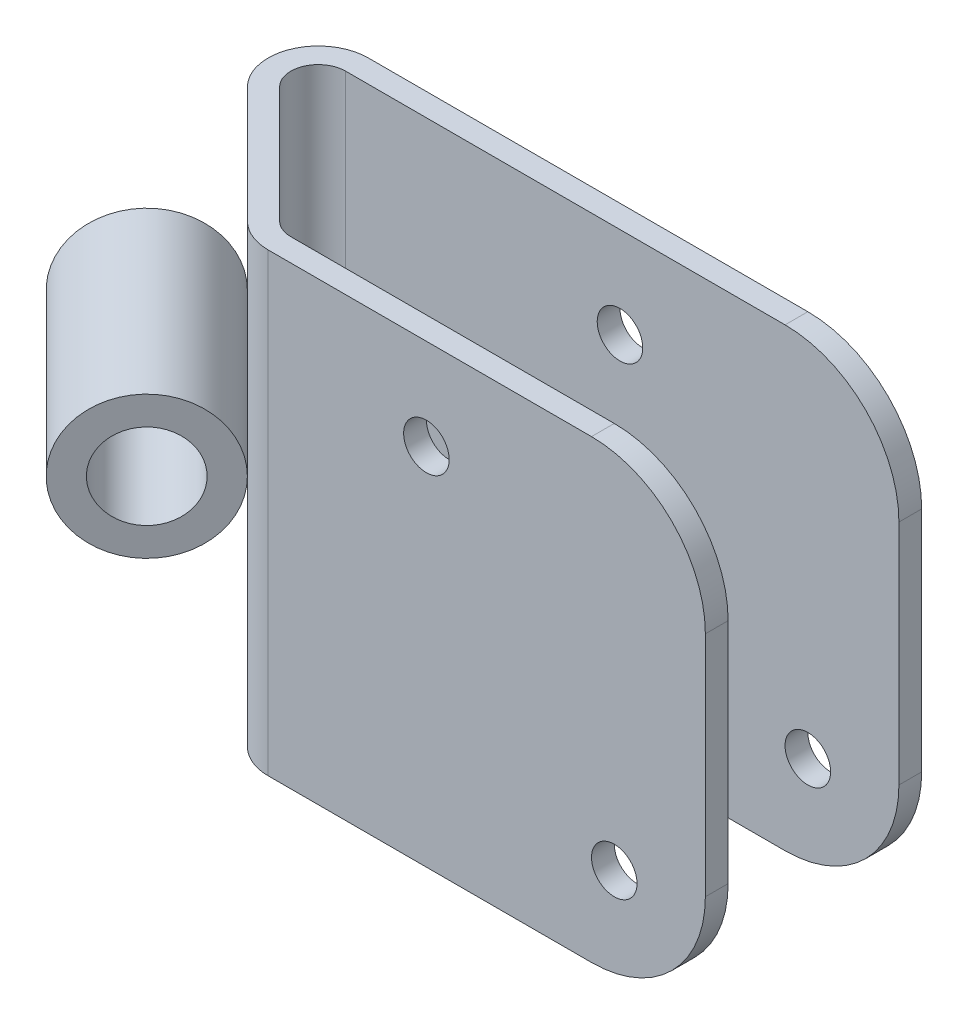
ISO-10303-21;
HEADER;
FILE_DESCRIPTION(('STEP AP214'),'2;1');
FILE_NAME('part.step','',(''),(''),'','','');
FILE_SCHEMA(('AUTOMOTIVE_DESIGN { 1 0 10303 214 1 1 1 1 }'));
ENDSEC;
DATA;
#1=APPLICATION_CONTEXT('core data for automotive mechanical design processes');
#2=APPLICATION_PROTOCOL_DEFINITION('international standard','automotive_design',2000,#1);
#3=PRODUCT_CONTEXT('',#1,'mechanical');
#4=PRODUCT('Part','Part','',(#3));
#5=PRODUCT_RELATED_PRODUCT_CATEGORY('part','',(#4));
#6=PRODUCT_DEFINITION_FORMATION('','',#4);
#7=PRODUCT_DEFINITION_CONTEXT('part definition',#1,'design');
#8=PRODUCT_DEFINITION('design','',#6,#7);
#9=PRODUCT_DEFINITION_SHAPE('','',#8);
#10=(LENGTH_UNIT() NAMED_UNIT(*) SI_UNIT(.MILLI.,.METRE.));
#11=(NAMED_UNIT(*) PLANE_ANGLE_UNIT() SI_UNIT($,.RADIAN.));
#12=(NAMED_UNIT(*) SI_UNIT($,.STERADIAN.) SOLID_ANGLE_UNIT());
#13=UNCERTAINTY_MEASURE_WITH_UNIT(LENGTH_MEASURE(1.E-05),#10,'distance_accuracy_value','');
#14=(GEOMETRIC_REPRESENTATION_CONTEXT(3) GLOBAL_UNCERTAINTY_ASSIGNED_CONTEXT((#13)) GLOBAL_UNIT_ASSIGNED_CONTEXT((#10,
#11,#12)) REPRESENTATION_CONTEXT('',''));
#15=CARTESIAN_POINT('',(0.,0.,0.));
#16=DIRECTION('',(0.,0.,1.));
#17=DIRECTION('',(1.,0.,0.));
#18=AXIS2_PLACEMENT_3D('',#15,#16,#17);
#19=CARTESIAN_POINT('',(2.64917555571536,0.,27.3651210935927));
#20=DIRECTION('',(0.707106781186546,0.,0.707106781186549));
#21=DIRECTION('',(0.707106781186549,0.,-0.707106781186546));
#22=AXIS2_PLACEMENT_3D('',#19,#20,#21);
#23=PLANE('',#22);
#24=CARTESIAN_POINT('',(2.64917555571536,0.,27.3651210935927));
#25=DIRECTION('',(0.707106781186546,0.,0.707106781186549));
#26=DIRECTION('',(0.707106781186549,0.,-0.707106781186546));
#27=AXIS2_PLACEMENT_3D('',#24,#25,#26);
#28=CIRCLE('',#27,7.9375);
#29=CARTESIAN_POINT('',(8.26183563138359,0.,21.7524610179245));
#30=VERTEX_POINT('',#29);
#31=EDGE_CURVE('E11',#30,#30,#28,.T.);
#32=ORIENTED_EDGE('',*,*,#31,.T.);
#33=EDGE_LOOP('',(#32));
#34=FACE_BOUND('',#33,.T.);
#35=CARTESIAN_POINT('',(2.64917555571536,0.,27.3651210935927));
#36=DIRECTION('',(0.707106781186546,0.,0.707106781186549));
#37=DIRECTION('',(0.707106781186549,0.,-0.707106781186546));
#38=AXIS2_PLACEMENT_3D('',#35,#36,#37);
#39=CIRCLE('',#38,4.7625);
#40=CARTESIAN_POINT('',(6.0167716011163,0.,23.9975250481918));
#41=VERTEX_POINT('',#40);
#42=EDGE_CURVE('E56',#41,#41,#39,.T.);
#43=ORIENTED_EDGE('',*,*,#42,.F.);
#44=EDGE_LOOP('',(#43));
#45=FACE_BOUND('',#44,.T.);
#46=ADVANCED_FACE('F45',(#34,#45),#23,.T.);
#47=CARTESIAN_POINT('',(-15.3113366864229,0.,9.40460885145436));
#48=DIRECTION('',(0.707106781186546,0.,0.707106781186549));
#49=DIRECTION('',(0.707106781186549,0.,-0.707106781186546));
#50=AXIS2_PLACEMENT_3D('',#47,#48,#49);
#51=PLANE('',#50);
#52=CARTESIAN_POINT('',(-15.3113366864229,0.,9.40460885145436));
#53=DIRECTION('',(0.707106781186546,0.,0.707106781186549));
#54=DIRECTION('',(0.707106781186549,0.,-0.707106781186546));
#55=AXIS2_PLACEMENT_3D('',#52,#53,#54);
#56=CIRCLE('',#55,7.9375);
#57=CARTESIAN_POINT('',(-9.69867661075468,0.,3.79194877578615));
#58=VERTEX_POINT('',#57);
#59=EDGE_CURVE('E49',#58,#58,#56,.T.);
#60=ORIENTED_EDGE('',*,*,#59,.F.);
#61=EDGE_LOOP('',(#60));
#62=FACE_BOUND('',#61,.T.);
#63=CARTESIAN_POINT('',(-15.3113366864229,0.,9.40460885145436));
#64=DIRECTION('',(0.707106781186546,0.,0.707106781186549));
#65=DIRECTION('',(0.707106781186549,0.,-0.707106781186546));
#66=AXIS2_PLACEMENT_3D('',#63,#64,#65);
#67=CIRCLE('',#66,4.7625);
#68=CARTESIAN_POINT('',(-11.943740641022,0.,6.03701280605344));
#69=VERTEX_POINT('',#68);
#70=EDGE_CURVE('E58',#69,#69,#67,.T.);
#71=ORIENTED_EDGE('',*,*,#70,.T.);
#72=EDGE_LOOP('',(#71));
#73=FACE_BOUND('',#72,.T.);
#74=ADVANCED_FACE('F68',(#62,#73),#51,.F.);
#75=CARTESIAN_POINT('',(2.64917555571536,0.,27.3651210935927));
#76=DIRECTION('',(-0.707106781186546,0.,-0.707106781186549));
#77=DIRECTION('',(-0.707106781186549,0.,0.707106781186546));
#78=AXIS2_PLACEMENT_3D('',#75,#76,#77);
#79=CYLINDRICAL_SURFACE('',#78,7.9375);
#80=ORIENTED_EDGE('',*,*,#31,.F.);
#81=EDGE_LOOP('',(#80));
#82=FACE_BOUND('',#81,.T.);
#83=ORIENTED_EDGE('',*,*,#59,.T.);
#84=EDGE_LOOP('',(#83));
#85=FACE_BOUND('',#84,.T.);
#86=ADVANCED_FACE('F47',(#82,#85),#79,.T.);
#87=CARTESIAN_POINT('',(2.64917555571536,0.,27.3651210935927));
#88=DIRECTION('',(-0.707106781186546,0.,-0.707106781186549));
#89=DIRECTION('',(-0.707106781186549,0.,0.707106781186546));
#90=AXIS2_PLACEMENT_3D('',#87,#88,#89);
#91=CYLINDRICAL_SURFACE('',#90,4.7625);
#92=ORIENTED_EDGE('',*,*,#42,.T.);
#93=EDGE_LOOP('',(#92));
#94=FACE_BOUND('',#93,.T.);
#95=ORIENTED_EDGE('',*,*,#70,.F.);
#96=EDGE_LOOP('',(#95));
#97=FACE_BOUND('',#96,.T.);
#98=ADVANCED_FACE('F64',(#94,#97),#91,.F.);
#99=CLOSED_SHELL('',(#46,#74,#86,#98));
#100=MANIFOLD_SOLID_BREP('B2',#99);
#101=CARTESIAN_POINT('',(12.954,25.4,24.13));
#102=DIRECTION('',(0.,0.,-1.));
#103=DIRECTION('',(-1.,0.,0.));
#104=AXIS2_PLACEMENT_3D('',#101,#102,#103);
#105=PLANE('',#104);
#106=CARTESIAN_POINT('',(51.562,-15.24,24.13));
#107=DIRECTION('',(0.,0.,-1.));
#108=DIRECTION('',(-1.,0.,0.));
#109=AXIS2_PLACEMENT_3D('',#106,#107,#108);
#110=CIRCLE('',#109,2.54);
#111=CARTESIAN_POINT('',(49.022,-15.24,24.13));
#112=VERTEX_POINT('',#111);
#113=EDGE_CURVE('E268',#112,#112,#110,.T.);
#114=ORIENTED_EDGE('',*,*,#113,.T.);
#115=EDGE_LOOP('',(#114));
#116=FACE_BOUND('',#115,.T.);
#117=CARTESIAN_POINT('',(30.607,15.24,24.13));
#118=DIRECTION('',(0.,0.,-1.));
#119=DIRECTION('',(-1.,0.,0.));
#120=AXIS2_PLACEMENT_3D('',#117,#118,#119);
#121=CIRCLE('',#120,2.53999999999999);
#122=CARTESIAN_POINT('',(28.067,15.24,24.13));
#123=VERTEX_POINT('',#122);
#124=EDGE_CURVE('E441',#123,#123,#121,.T.);
#125=ORIENTED_EDGE('',*,*,#124,.T.);
#126=EDGE_LOOP('',(#125));
#127=FACE_BOUND('',#126,.T.);
#128=DIRECTION('',(1.,0.,0.));
#129=VECTOR('',#128,1.);
#130=CARTESIAN_POINT('',(12.954,-25.4,24.13));
#131=LINE('',#130,#129);
#132=CARTESIAN_POINT('',(12.954,-25.4,24.13));
#133=VERTEX_POINT('',#132);
#134=CARTESIAN_POINT('',(49.022,-25.4,24.13));
#135=VERTEX_POINT('',#134);
#136=EDGE_CURVE('E265',#133,#135,#131,.T.);
#137=ORIENTED_EDGE('',*,*,#136,.T.);
#138=CARTESIAN_POINT('',(49.022,-12.7,24.13));
#139=DIRECTION('',(0.,0.,-1.));
#140=DIRECTION('',(-1.,0.,0.));
#141=AXIS2_PLACEMENT_3D('',#138,#139,#140);
#142=CIRCLE('',#141,12.7);
#143=CARTESIAN_POINT('',(61.722,-12.7,24.13));
#144=VERTEX_POINT('',#143);
#145=EDGE_CURVE('E321',#135,#144,#142,.F.);
#146=ORIENTED_EDGE('',*,*,#145,.T.);
#147=DIRECTION('',(0.,-1.,0.));
#148=VECTOR('',#147,1.);
#149=CARTESIAN_POINT('',(61.722,25.4,24.13));
#150=LINE('',#149,#148);
#151=CARTESIAN_POINT('',(61.722,12.7,24.13));
#152=VERTEX_POINT('',#151);
#153=EDGE_CURVE('E310',#152,#144,#150,.T.);
#154=ORIENTED_EDGE('',*,*,#153,.F.);
#155=CARTESIAN_POINT('',(49.022,12.7,24.13));
#156=DIRECTION('',(0.,0.,-1.));
#157=DIRECTION('',(-1.,0.,0.));
#158=AXIS2_PLACEMENT_3D('',#155,#156,#157);
#159=CIRCLE('',#158,12.7);
#160=CARTESIAN_POINT('',(49.022,25.4,24.13));
#161=VERTEX_POINT('',#160);
#162=EDGE_CURVE('E319',#152,#161,#159,.F.);
#163=ORIENTED_EDGE('',*,*,#162,.T.);
#164=DIRECTION('',(1.,0.,0.));
#165=VECTOR('',#164,1.);
#166=CARTESIAN_POINT('',(12.954,25.4,24.13));
#167=LINE('',#166,#165);
#168=CARTESIAN_POINT('',(12.954,25.4,24.13));
#169=VERTEX_POINT('',#168);
#170=EDGE_CURVE('E243',#169,#161,#167,.T.);
#171=ORIENTED_EDGE('',*,*,#170,.F.);
#172=DIRECTION('',(0.,-1.,0.));
#173=VECTOR('',#172,1.);
#174=CARTESIAN_POINT('',(12.954,25.4,24.13));
#175=LINE('',#174,#173);
#176=EDGE_CURVE('E264',#169,#133,#175,.T.);
#177=ORIENTED_EDGE('',*,*,#176,.T.);
#178=EDGE_LOOP('',(#137,#146,#154,#163,#171,#177));
#179=FACE_BOUND('',#178,.T.);
#180=ADVANCED_FACE('F107',(#116,#127,#179),#105,.F.);
#181=CARTESIAN_POINT('',(61.722,25.4,21.59));
#182=DIRECTION('',(1.,0.,0.));
#183=DIRECTION('',(0.,0.,-1.));
#184=AXIS2_PLACEMENT_3D('',#181,#182,#183);
#185=PLANE('',#184);
#186=ORIENTED_EDGE('',*,*,#153,.T.);
#187=DIRECTION('',(0.,0.,1.));
#188=VECTOR('',#187,1.);
#189=CARTESIAN_POINT('',(61.722,-12.7,21.59));
#190=LINE('',#189,#188);
#191=CARTESIAN_POINT('',(61.722,-12.7,21.59));
#192=VERTEX_POINT('',#191);
#193=EDGE_CURVE('E326',#144,#192,#190,.F.);
#194=ORIENTED_EDGE('',*,*,#193,.T.);
#195=DIRECTION('',(0.,-1.,0.));
#196=VECTOR('',#195,1.);
#197=CARTESIAN_POINT('',(61.722,25.4,21.59));
#198=LINE('',#197,#196);
#199=CARTESIAN_POINT('',(61.722,12.7,21.59));
#200=VERTEX_POINT('',#199);
#201=EDGE_CURVE('E233',#200,#192,#198,.T.);
#202=ORIENTED_EDGE('',*,*,#201,.F.);
#203=DIRECTION('',(0.,0.,1.));
#204=VECTOR('',#203,1.);
#205=CARTESIAN_POINT('',(61.722,12.7,21.59));
#206=LINE('',#205,#204);
#207=EDGE_CURVE('E323',#200,#152,#206,.T.);
#208=ORIENTED_EDGE('',*,*,#207,.T.);
#209=EDGE_LOOP('',(#186,#194,#202,#208));
#210=FACE_BOUND('',#209,.T.);
#211=ADVANCED_FACE('F381',(#210),#185,.T.);
#212=CARTESIAN_POINT('',(12.954,25.4,21.59));
#213=DIRECTION('',(0.,0.,-1.));
#214=DIRECTION('',(-1.,0.,0.));
#215=AXIS2_PLACEMENT_3D('',#212,#213,#214);
#216=PLANE('',#215);
#217=CARTESIAN_POINT('',(51.562,-15.24,21.59));
#218=DIRECTION('',(0.,0.,-1.));
#219=DIRECTION('',(-1.,0.,0.));
#220=AXIS2_PLACEMENT_3D('',#217,#218,#219);
#221=CIRCLE('',#220,2.54);
#222=CARTESIAN_POINT('',(49.022,-15.24,21.59));
#223=VERTEX_POINT('',#222);
#224=EDGE_CURVE('E435',#223,#223,#221,.T.);
#225=ORIENTED_EDGE('',*,*,#224,.F.);
#226=EDGE_LOOP('',(#225));
#227=FACE_BOUND('',#226,.T.);
#228=CARTESIAN_POINT('',(30.607,15.24,21.59));
#229=DIRECTION('',(0.,0.,-1.));
#230=DIRECTION('',(-1.,0.,0.));
#231=AXIS2_PLACEMENT_3D('',#228,#229,#230);
#232=CIRCLE('',#231,2.53999999999999);
#233=CARTESIAN_POINT('',(28.067,15.24,21.59));
#234=VERTEX_POINT('',#233);
#235=EDGE_CURVE('E444',#234,#234,#232,.T.);
#236=ORIENTED_EDGE('',*,*,#235,.F.);
#237=EDGE_LOOP('',(#236));
#238=FACE_BOUND('',#237,.T.);
#239=ORIENTED_EDGE('',*,*,#201,.T.);
#240=CARTESIAN_POINT('',(49.022,-12.7,21.59));
#241=DIRECTION('',(0.,0.,-1.));
#242=DIRECTION('',(-1.,0.,0.));
#243=AXIS2_PLACEMENT_3D('',#240,#241,#242);
#244=CIRCLE('',#243,12.7);
#245=CARTESIAN_POINT('',(49.022,-25.4,21.59));
#246=VERTEX_POINT('',#245);
#247=EDGE_CURVE('E330',#192,#246,#244,.T.);
#248=ORIENTED_EDGE('',*,*,#247,.T.);
#249=DIRECTION('',(1.,0.,0.));
#250=VECTOR('',#249,1.);
#251=CARTESIAN_POINT('',(12.954,-25.4,21.59));
#252=LINE('',#251,#250);
#253=CARTESIAN_POINT('',(12.954,-25.4,21.59));
#254=VERTEX_POINT('',#253);
#255=EDGE_CURVE('E228',#254,#246,#252,.T.);
#256=ORIENTED_EDGE('',*,*,#255,.F.);
#257=DIRECTION('',(0.,-1.,0.));
#258=VECTOR('',#257,1.);
#259=CARTESIAN_POINT('',(12.954,25.4,21.59));
#260=LINE('',#259,#258);
#261=CARTESIAN_POINT('',(12.954,25.4,21.59));
#262=VERTEX_POINT('',#261);
#263=EDGE_CURVE('E221',#262,#254,#260,.T.);
#264=ORIENTED_EDGE('',*,*,#263,.F.);
#265=DIRECTION('',(1.,0.,0.));
#266=VECTOR('',#265,1.);
#267=CARTESIAN_POINT('',(12.954,25.4,21.59));
#268=LINE('',#267,#266);
#269=CARTESIAN_POINT('',(49.022,25.4,21.59));
#270=VERTEX_POINT('',#269);
#271=EDGE_CURVE('E225',#262,#270,#268,.T.);
#272=ORIENTED_EDGE('',*,*,#271,.T.);
#273=CARTESIAN_POINT('',(49.022,12.7,21.59));
#274=DIRECTION('',(0.,0.,-1.));
#275=DIRECTION('',(-1.,0.,0.));
#276=AXIS2_PLACEMENT_3D('',#273,#274,#275);
#277=CIRCLE('',#276,12.7);
#278=EDGE_CURVE('E328',#270,#200,#277,.T.);
#279=ORIENTED_EDGE('',*,*,#278,.T.);
#280=EDGE_LOOP('',(#239,#248,#256,#264,#272,#279));
#281=FACE_BOUND('',#280,.T.);
#282=ADVANCED_FACE('F224',(#227,#238,#281),#216,.T.);
#283=CARTESIAN_POINT('',(12.954,25.4,18.542));
#284=DIRECTION('',(0.,-1.,0.));
#285=DIRECTION('',(0.,0.,-1.));
#286=AXIS2_PLACEMENT_3D('',#283,#284,#285);
#287=CYLINDRICAL_SURFACE('',#286,3.048);
#288=CARTESIAN_POINT('',(12.954,-25.4,18.542));
#289=DIRECTION('',(0.,1.,0.));
#290=DIRECTION('',(1.,0.,0.));
#291=AXIS2_PLACEMENT_3D('',#288,#289,#290);
#292=CIRCLE('',#291,3.048);
#293=CARTESIAN_POINT('',(10.7987385309434,-25.4,20.6972614690566));
#294=VERTEX_POINT('',#293);
#295=EDGE_CURVE('E270',#294,#254,#292,.T.);
#296=ORIENTED_EDGE('',*,*,#295,.F.);
#297=DIRECTION('',(0.,-1.,0.));
#298=VECTOR('',#297,1.);
#299=CARTESIAN_POINT('',(10.7987385309434,25.4,20.6972614690566));
#300=LINE('',#299,#298);
#301=CARTESIAN_POINT('',(10.7987385309434,25.4,20.6972614690566));
#302=VERTEX_POINT('',#301);
#303=EDGE_CURVE('E234',#302,#294,#300,.T.);
#304=ORIENTED_EDGE('',*,*,#303,.F.);
#305=CARTESIAN_POINT('',(12.954,25.4,18.542));
#306=DIRECTION('',(0.,1.,0.));
#307=DIRECTION('',(1.,0.,0.));
#308=AXIS2_PLACEMENT_3D('',#305,#306,#307);
#309=CIRCLE('',#308,3.048);
#310=EDGE_CURVE('E239',#302,#262,#309,.T.);
#311=ORIENTED_EDGE('',*,*,#310,.T.);
#312=ORIENTED_EDGE('',*,*,#263,.T.);
#313=EDGE_LOOP('',(#296,#304,#311,#312));
#314=FACE_BOUND('',#313,.T.);
#315=ADVANCED_FACE('F245',(#314),#287,.F.);
#316=CARTESIAN_POINT('',(-2.1552614690566,25.4,7.74326146905659));
#317=DIRECTION('',(0.707106781186548,0.,-0.707106781186547));
#318=DIRECTION('',(-0.707106781186547,0.,-0.707106781186548));
#319=AXIS2_PLACEMENT_3D('',#316,#317,#318);
#320=PLANE('',#319);
#321=DIRECTION('',(0.707106781186547,0.,0.707106781186548));
#322=VECTOR('',#321,1.);
#323=CARTESIAN_POINT('',(-2.1552614690566,-25.4,7.74326146905659));
#324=LINE('',#323,#322);
#325=CARTESIAN_POINT('',(-2.1552614690566,-25.4,7.74326146905659));
#326=VERTEX_POINT('',#325);
#327=EDGE_CURVE('E272',#326,#294,#324,.T.);
#328=ORIENTED_EDGE('',*,*,#327,.F.);
#329=DIRECTION('',(0.,-1.,0.));
#330=VECTOR('',#329,1.);
#331=CARTESIAN_POINT('',(-2.1552614690566,25.4,7.74326146905659));
#332=LINE('',#331,#330);
#333=CARTESIAN_POINT('',(-2.1552614690566,25.4,7.74326146905659));
#334=VERTEX_POINT('',#333);
#335=EDGE_CURVE('E306',#334,#326,#332,.T.);
#336=ORIENTED_EDGE('',*,*,#335,.F.);
#337=DIRECTION('',(0.707106781186547,0.,0.707106781186548));
#338=VECTOR('',#337,1.);
#339=CARTESIAN_POINT('',(-2.1552614690566,25.4,7.74326146905659));
#340=LINE('',#339,#338);
#341=EDGE_CURVE('E246',#334,#302,#340,.T.);
#342=ORIENTED_EDGE('',*,*,#341,.T.);
#343=ORIENTED_EDGE('',*,*,#303,.T.);
#344=EDGE_LOOP('',(#328,#336,#342,#343));
#345=FACE_BOUND('',#344,.T.);
#346=ADVANCED_FACE('F371',(#345),#320,.T.);
#347=CARTESIAN_POINT('',(0.,25.4,5.588));
#348=DIRECTION('',(0.,-1.,0.));
#349=DIRECTION('',(0.,0.,-1.));
#350=AXIS2_PLACEMENT_3D('',#347,#348,#349);
#351=CYLINDRICAL_SURFACE('',#350,3.048);
#352=CARTESIAN_POINT('',(0.,-25.4,5.588));
#353=DIRECTION('',(0.,1.,0.));
#354=DIRECTION('',(1.,0.,0.));
#355=AXIS2_PLACEMENT_3D('',#352,#353,#354);
#356=CIRCLE('',#355,3.048);
#357=CARTESIAN_POINT('',(0.,-25.4,2.54));
#358=VERTEX_POINT('',#357);
#359=EDGE_CURVE('E275',#358,#326,#356,.T.);
#360=ORIENTED_EDGE('',*,*,#359,.F.);
#361=DIRECTION('',(0.,-1.,0.));
#362=VECTOR('',#361,1.);
#363=CARTESIAN_POINT('',(0.,25.4,2.54));
#364=LINE('',#363,#362);
#365=CARTESIAN_POINT('',(0.,25.4,2.54));
#366=VERTEX_POINT('',#365);
#367=EDGE_CURVE('E303',#366,#358,#364,.T.);
#368=ORIENTED_EDGE('',*,*,#367,.F.);
#369=CARTESIAN_POINT('',(0.,25.4,5.588));
#370=DIRECTION('',(0.,1.,0.));
#371=DIRECTION('',(1.,0.,0.));
#372=AXIS2_PLACEMENT_3D('',#369,#370,#371);
#373=CIRCLE('',#372,3.048);
#374=EDGE_CURVE('E248',#366,#334,#373,.T.);
#375=ORIENTED_EDGE('',*,*,#374,.T.);
#376=ORIENTED_EDGE('',*,*,#335,.T.);
#377=EDGE_LOOP('',(#360,#368,#375,#376));
#378=FACE_BOUND('',#377,.T.);
#379=ADVANCED_FACE('F368',(#378),#351,.F.);
#380=CARTESIAN_POINT('',(0.,25.4,2.54));
#381=DIRECTION('',(0.,0.,1.));
#382=DIRECTION('',(1.,0.,0.));
#383=AXIS2_PLACEMENT_3D('',#380,#381,#382);
#384=PLANE('',#383);
#385=CARTESIAN_POINT('',(51.562,-15.24,2.54));
#386=DIRECTION('',(0.,0.,1.));
#387=DIRECTION('',(1.,0.,0.));
#388=AXIS2_PLACEMENT_3D('',#385,#386,#387);
#389=CIRCLE('',#388,2.54);
#390=CARTESIAN_POINT('',(54.102,-15.24,2.54));
#391=VERTEX_POINT('',#390);
#392=EDGE_CURVE('E438',#391,#391,#389,.T.);
#393=ORIENTED_EDGE('',*,*,#392,.F.);
#394=EDGE_LOOP('',(#393));
#395=FACE_BOUND('',#394,.T.);
#396=CARTESIAN_POINT('',(30.607,15.24,2.54));
#397=DIRECTION('',(0.,0.,1.));
#398=DIRECTION('',(1.,0.,0.));
#399=AXIS2_PLACEMENT_3D('',#396,#397,#398);
#400=CIRCLE('',#399,2.53999999999999);
#401=CARTESIAN_POINT('',(33.147,15.24,2.54));
#402=VERTEX_POINT('',#401);
#403=EDGE_CURVE('E447',#402,#402,#400,.T.);
#404=ORIENTED_EDGE('',*,*,#403,.F.);
#405=EDGE_LOOP('',(#404));
#406=FACE_BOUND('',#405,.T.);
#407=DIRECTION('',(1.,0.,0.));
#408=VECTOR('',#407,1.);
#409=CARTESIAN_POINT('',(0.,-25.4,2.54));
#410=LINE('',#409,#408);
#411=CARTESIAN_POINT('',(49.022,-25.4,2.54));
#412=VERTEX_POINT('',#411);
#413=EDGE_CURVE('E278',#412,#358,#410,.F.);
#414=ORIENTED_EDGE('',*,*,#413,.F.);
#415=CARTESIAN_POINT('',(49.022,-12.7,2.54));
#416=DIRECTION('',(0.,0.,1.));
#417=DIRECTION('',(1.,0.,0.));
#418=AXIS2_PLACEMENT_3D('',#415,#416,#417);
#419=CIRCLE('',#418,12.7);
#420=CARTESIAN_POINT('',(61.722,-12.7,2.54));
#421=VERTEX_POINT('',#420);
#422=EDGE_CURVE('E334',#412,#421,#419,.T.);
#423=ORIENTED_EDGE('',*,*,#422,.T.);
#424=DIRECTION('',(0.,-1.,0.));
#425=VECTOR('',#424,1.);
#426=CARTESIAN_POINT('',(61.722,25.4,2.54));
#427=LINE('',#426,#425);
#428=CARTESIAN_POINT('',(61.722,12.7,2.54));
#429=VERTEX_POINT('',#428);
#430=EDGE_CURVE('E301',#429,#421,#427,.T.);
#431=ORIENTED_EDGE('',*,*,#430,.F.);
#432=CARTESIAN_POINT('',(49.022,12.7,2.54));
#433=DIRECTION('',(0.,0.,1.));
#434=DIRECTION('',(1.,0.,0.));
#435=AXIS2_PLACEMENT_3D('',#432,#433,#434);
#436=CIRCLE('',#435,12.7);
#437=CARTESIAN_POINT('',(49.022,25.4,2.54));
#438=VERTEX_POINT('',#437);
#439=EDGE_CURVE('E332',#429,#438,#436,.T.);
#440=ORIENTED_EDGE('',*,*,#439,.T.);
#441=DIRECTION('',(1.,0.,0.));
#442=VECTOR('',#441,1.);
#443=CARTESIAN_POINT('',(0.,25.4,2.54));
#444=LINE('',#443,#442);
#445=EDGE_CURVE('E254',#438,#366,#444,.F.);
#446=ORIENTED_EDGE('',*,*,#445,.T.);
#447=ORIENTED_EDGE('',*,*,#367,.T.);
#448=EDGE_LOOP('',(#414,#423,#431,#440,#446,#447));
#449=FACE_BOUND('',#448,.T.);
#450=ADVANCED_FACE('F358',(#395,#406,#449),#384,.T.);
#451=CARTESIAN_POINT('',(61.722,25.4,0.));
#452=DIRECTION('',(1.,0.,0.));
#453=DIRECTION('',(0.,0.,-1.));
#454=AXIS2_PLACEMENT_3D('',#451,#452,#453);
#455=PLANE('',#454);
#456=ORIENTED_EDGE('',*,*,#430,.T.);
#457=DIRECTION('',(0.,0.,1.));
#458=VECTOR('',#457,1.);
#459=CARTESIAN_POINT('',(61.722,-12.7,0.));
#460=LINE('',#459,#458);
#461=CARTESIAN_POINT('',(61.722,-12.7,0.));
#462=VERTEX_POINT('',#461);
#463=EDGE_CURVE('E128',#421,#462,#460,.F.);
#464=ORIENTED_EDGE('',*,*,#463,.T.);
#465=DIRECTION('',(0.,-1.,0.));
#466=VECTOR('',#465,1.);
#467=CARTESIAN_POINT('',(61.722,25.4,0.));
#468=LINE('',#467,#466);
#469=CARTESIAN_POINT('',(61.722,12.7,0.));
#470=VERTEX_POINT('',#469);
#471=EDGE_CURVE('E299',#470,#462,#468,.T.);
#472=ORIENTED_EDGE('',*,*,#471,.F.);
#473=DIRECTION('',(0.,0.,1.));
#474=VECTOR('',#473,1.);
#475=CARTESIAN_POINT('',(61.722,12.7,0.));
#476=LINE('',#475,#474);
#477=EDGE_CURVE('E336',#470,#429,#476,.T.);
#478=ORIENTED_EDGE('',*,*,#477,.T.);
#479=EDGE_LOOP('',(#456,#464,#472,#478));
#480=FACE_BOUND('',#479,.T.);
#481=ADVANCED_FACE('F359',(#480),#455,.T.);
#482=CARTESIAN_POINT('',(0.,25.4,0.));
#483=DIRECTION('',(0.,0.,1.));
#484=DIRECTION('',(1.,0.,0.));
#485=AXIS2_PLACEMENT_3D('',#482,#483,#484);
#486=PLANE('',#485);
#487=CARTESIAN_POINT('',(51.562,-15.24,0.));
#488=DIRECTION('',(0.,0.,-1.));
#489=DIRECTION('',(-1.,0.,0.));
#490=AXIS2_PLACEMENT_3D('',#487,#488,#489);
#491=CIRCLE('',#490,2.54);
#492=CARTESIAN_POINT('',(49.022,-15.24,0.));
#493=VERTEX_POINT('',#492);
#494=EDGE_CURVE('E450',#493,#493,#491,.T.);
#495=ORIENTED_EDGE('',*,*,#494,.F.);
#496=EDGE_LOOP('',(#495));
#497=FACE_BOUND('',#496,.T.);
#498=CARTESIAN_POINT('',(30.607,15.24,0.));
#499=DIRECTION('',(0.,0.,-1.));
#500=DIRECTION('',(-1.,0.,0.));
#501=AXIS2_PLACEMENT_3D('',#498,#499,#500);
#502=CIRCLE('',#501,2.53999999999999);
#503=CARTESIAN_POINT('',(28.067,15.24,0.));
#504=VERTEX_POINT('',#503);
#505=EDGE_CURVE('E451',#504,#504,#502,.T.);
#506=ORIENTED_EDGE('',*,*,#505,.F.);
#507=EDGE_LOOP('',(#506));
#508=FACE_BOUND('',#507,.T.);
#509=ORIENTED_EDGE('',*,*,#471,.T.);
#510=CARTESIAN_POINT('',(49.022,-12.7,0.));
#511=DIRECTION('',(0.,0.,1.));
#512=DIRECTION('',(1.,0.,0.));
#513=AXIS2_PLACEMENT_3D('',#510,#511,#512);
#514=CIRCLE('',#513,12.7);
#515=CARTESIAN_POINT('',(49.022,-25.4,0.));
#516=VERTEX_POINT('',#515);
#517=EDGE_CURVE('E342',#462,#516,#514,.F.);
#518=ORIENTED_EDGE('',*,*,#517,.T.);
#519=DIRECTION('',(-1.,0.,0.));
#520=VECTOR('',#519,1.);
#521=CARTESIAN_POINT('',(0.,-25.4,0.));
#522=LINE('',#521,#520);
#523=CARTESIAN_POINT('',(0.,-25.4,0.));
#524=VERTEX_POINT('',#523);
#525=EDGE_CURVE('E280',#516,#524,#522,.T.);
#526=ORIENTED_EDGE('',*,*,#525,.T.);
#527=DIRECTION('',(0.,-1.,0.));
#528=VECTOR('',#527,1.);
#529=CARTESIAN_POINT('',(0.,25.4,0.));
#530=LINE('',#529,#528);
#531=CARTESIAN_POINT('',(0.,25.4,0.));
#532=VERTEX_POINT('',#531);
#533=EDGE_CURVE('E296',#532,#524,#530,.T.);
#534=ORIENTED_EDGE('',*,*,#533,.F.);
#535=DIRECTION('',(-1.,0.,0.));
#536=VECTOR('',#535,1.);
#537=CARTESIAN_POINT('',(0.,25.4,0.));
#538=LINE('',#537,#536);
#539=CARTESIAN_POINT('',(49.022,25.4,0.));
#540=VERTEX_POINT('',#539);
#541=EDGE_CURVE('E256',#540,#532,#538,.T.);
#542=ORIENTED_EDGE('',*,*,#541,.F.);
#543=CARTESIAN_POINT('',(49.022,12.7,0.));
#544=DIRECTION('',(0.,0.,1.));
#545=DIRECTION('',(1.,0.,0.));
#546=AXIS2_PLACEMENT_3D('',#543,#544,#545);
#547=CIRCLE('',#546,12.7);
#548=EDGE_CURVE('E340',#540,#470,#547,.F.);
#549=ORIENTED_EDGE('',*,*,#548,.T.);
#550=EDGE_LOOP('',(#509,#518,#526,#534,#542,#549));
#551=FACE_BOUND('',#550,.T.);
#552=ADVANCED_FACE('F346',(#497,#508,#551),#486,.F.);
#553=CARTESIAN_POINT('',(0.,25.4,5.588));
#554=DIRECTION('',(0.,-1.,0.));
#555=DIRECTION('',(0.,0.,-1.));
#556=AXIS2_PLACEMENT_3D('',#553,#554,#555);
#557=CYLINDRICAL_SURFACE('',#556,5.588);
#558=CARTESIAN_POINT('',(0.,-25.4,5.588));
#559=DIRECTION('',(0.,1.,0.));
#560=DIRECTION('',(0.,0.,1.));
#561=AXIS2_PLACEMENT_3D('',#558,#559,#560);
#562=CIRCLE('',#561,5.588);
#563=CARTESIAN_POINT('',(-3.95131269327043,-25.4,9.53931269327042));
#564=VERTEX_POINT('',#563);
#565=EDGE_CURVE('E282',#524,#564,#562,.T.);
#566=ORIENTED_EDGE('',*,*,#565,.T.);
#567=DIRECTION('',(0.,-1.,0.));
#568=VECTOR('',#567,1.);
#569=CARTESIAN_POINT('',(-3.95131269327043,25.4,9.53931269327042));
#570=LINE('',#569,#568);
#571=CARTESIAN_POINT('',(-3.95131269327043,25.4,9.53931269327042));
#572=VERTEX_POINT('',#571);
#573=EDGE_CURVE('E293',#572,#564,#570,.T.);
#574=ORIENTED_EDGE('',*,*,#573,.F.);
#575=CARTESIAN_POINT('',(0.,25.4,5.588));
#576=DIRECTION('',(0.,1.,0.));
#577=DIRECTION('',(0.,0.,1.));
#578=AXIS2_PLACEMENT_3D('',#575,#576,#577);
#579=CIRCLE('',#578,5.588);
#580=EDGE_CURVE('E258',#532,#572,#579,.T.);
#581=ORIENTED_EDGE('',*,*,#580,.F.);
#582=ORIENTED_EDGE('',*,*,#533,.T.);
#583=EDGE_LOOP('',(#566,#574,#581,#582));
#584=FACE_BOUND('',#583,.T.);
#585=ADVANCED_FACE('F432',(#584),#557,.T.);
#586=CARTESIAN_POINT('',(-3.95131269327043,25.4,9.53931269327042));
#587=DIRECTION('',(0.707106781186548,0.,-0.707106781186547));
#588=DIRECTION('',(-0.707106781186547,0.,-0.707106781186548));
#589=AXIS2_PLACEMENT_3D('',#586,#587,#588);
#590=PLANE('',#589);
#591=DIRECTION('',(0.707106781186547,0.,0.707106781186548));
#592=VECTOR('',#591,1.);
#593=CARTESIAN_POINT('',(-3.95131269327043,-25.4,9.53931269327042));
#594=LINE('',#593,#592);
#595=CARTESIAN_POINT('',(9.00268730672953,-25.4,22.4933126932704));
#596=VERTEX_POINT('',#595);
#597=EDGE_CURVE('E284',#564,#596,#594,.T.);
#598=ORIENTED_EDGE('',*,*,#597,.T.);
#599=DIRECTION('',(0.,-1.,0.));
#600=VECTOR('',#599,1.);
#601=CARTESIAN_POINT('',(9.00268730672953,25.4,22.4933126932704));
#602=LINE('',#601,#600);
#603=CARTESIAN_POINT('',(9.00268730672953,25.4,22.4933126932704));
#604=VERTEX_POINT('',#603);
#605=EDGE_CURVE('E290',#604,#596,#602,.T.);
#606=ORIENTED_EDGE('',*,*,#605,.F.);
#607=DIRECTION('',(0.707106781186547,0.,0.707106781186548));
#608=VECTOR('',#607,1.);
#609=CARTESIAN_POINT('',(-3.95131269327043,25.4,9.53931269327042));
#610=LINE('',#609,#608);
#611=EDGE_CURVE('E260',#572,#604,#610,.T.);
#612=ORIENTED_EDGE('',*,*,#611,.F.);
#613=ORIENTED_EDGE('',*,*,#573,.T.);
#614=EDGE_LOOP('',(#598,#606,#612,#613));
#615=FACE_BOUND('',#614,.T.);
#616=ADVANCED_FACE('F427',(#615),#590,.F.);
#617=CARTESIAN_POINT('',(12.954,25.4,18.542));
#618=DIRECTION('',(0.,-1.,0.));
#619=DIRECTION('',(0.,0.,-1.));
#620=AXIS2_PLACEMENT_3D('',#617,#618,#619);
#621=CYLINDRICAL_SURFACE('',#620,5.588);
#622=CARTESIAN_POINT('',(12.954,-25.4,18.542));
#623=DIRECTION('',(0.,1.,0.));
#624=DIRECTION('',(0.,0.,1.));
#625=AXIS2_PLACEMENT_3D('',#622,#623,#624);
#626=CIRCLE('',#625,5.588);
#627=EDGE_CURVE('E286',#596,#133,#626,.T.);
#628=ORIENTED_EDGE('',*,*,#627,.T.);
#629=ORIENTED_EDGE('',*,*,#176,.F.);
#630=CARTESIAN_POINT('',(12.954,25.4,18.542));
#631=DIRECTION('',(0.,1.,0.));
#632=DIRECTION('',(0.,0.,1.));
#633=AXIS2_PLACEMENT_3D('',#630,#631,#632);
#634=CIRCLE('',#633,5.588);
#635=EDGE_CURVE('E262',#604,#169,#634,.T.);
#636=ORIENTED_EDGE('',*,*,#635,.F.);
#637=ORIENTED_EDGE('',*,*,#605,.T.);
#638=EDGE_LOOP('',(#628,#629,#636,#637));
#639=FACE_BOUND('',#638,.T.);
#640=ADVANCED_FACE('F424',(#639),#621,.T.);
#641=CARTESIAN_POINT('',(12.954,25.4,18.542));
#642=DIRECTION('',(0.,1.,0.));
#643=DIRECTION('',(1.,0.,0.));
#644=AXIS2_PLACEMENT_3D('',#641,#642,#643);
#645=PLANE('',#644);
#646=ORIENTED_EDGE('',*,*,#445,.F.);
#647=DIRECTION('',(0.,0.,1.));
#648=VECTOR('',#647,1.);
#649=CARTESIAN_POINT('',(49.022,25.4,18.542));
#650=LINE('',#649,#648);
#651=EDGE_CURVE('E43',#438,#540,#650,.F.);
#652=ORIENTED_EDGE('',*,*,#651,.T.);
#653=ORIENTED_EDGE('',*,*,#541,.T.);
#654=ORIENTED_EDGE('',*,*,#580,.T.);
#655=ORIENTED_EDGE('',*,*,#611,.T.);
#656=ORIENTED_EDGE('',*,*,#635,.T.);
#657=ORIENTED_EDGE('',*,*,#170,.T.);
#658=DIRECTION('',(0.,0.,1.));
#659=VECTOR('',#658,1.);
#660=CARTESIAN_POINT('',(49.022,25.4,18.542));
#661=LINE('',#660,#659);
#662=EDGE_CURVE('E115',#161,#270,#661,.F.);
#663=ORIENTED_EDGE('',*,*,#662,.T.);
#664=ORIENTED_EDGE('',*,*,#271,.F.);
#665=ORIENTED_EDGE('',*,*,#310,.F.);
#666=ORIENTED_EDGE('',*,*,#341,.F.);
#667=ORIENTED_EDGE('',*,*,#374,.F.);
#668=EDGE_LOOP('',(#646,#652,#653,#654,#655,#656,#657,#663,#664,#665,#666,#667));
#669=FACE_BOUND('',#668,.T.);
#670=ADVANCED_FACE('F237',(#669),#645,.T.);
#671=CARTESIAN_POINT('',(12.954,-25.4,18.542));
#672=DIRECTION('',(0.,1.,0.));
#673=DIRECTION('',(1.,0.,0.));
#674=AXIS2_PLACEMENT_3D('',#671,#672,#673);
#675=PLANE('',#674);
#676=ORIENTED_EDGE('',*,*,#255,.T.);
#677=DIRECTION('',(0.,0.,1.));
#678=VECTOR('',#677,1.);
#679=CARTESIAN_POINT('',(49.022,-25.4,24.13));
#680=LINE('',#679,#678);
#681=EDGE_CURVE('E316',#246,#135,#680,.T.);
#682=ORIENTED_EDGE('',*,*,#681,.T.);
#683=ORIENTED_EDGE('',*,*,#136,.F.);
#684=ORIENTED_EDGE('',*,*,#627,.F.);
#685=ORIENTED_EDGE('',*,*,#597,.F.);
#686=ORIENTED_EDGE('',*,*,#565,.F.);
#687=ORIENTED_EDGE('',*,*,#525,.F.);
#688=DIRECTION('',(0.,0.,1.));
#689=VECTOR('',#688,1.);
#690=CARTESIAN_POINT('',(49.022,-25.4,2.54));
#691=LINE('',#690,#689);
#692=EDGE_CURVE('E313',#516,#412,#691,.T.);
#693=ORIENTED_EDGE('',*,*,#692,.T.);
#694=ORIENTED_EDGE('',*,*,#413,.T.);
#695=ORIENTED_EDGE('',*,*,#359,.T.);
#696=ORIENTED_EDGE('',*,*,#327,.T.);
#697=ORIENTED_EDGE('',*,*,#295,.T.);
#698=EDGE_LOOP('',(#676,#682,#683,#684,#685,#686,#687,#693,#694,#695,#696,#697));
#699=FACE_BOUND('',#698,.T.);
#700=ADVANCED_FACE('F352',(#699),#675,.F.);
#701=CARTESIAN_POINT('',(49.022,-12.7,18.542));
#702=DIRECTION('',(0.,0.,-1.));
#703=DIRECTION('',(-1.,0.,0.));
#704=AXIS2_PLACEMENT_3D('',#701,#702,#703);
#705=CYLINDRICAL_SURFACE('',#704,12.7);
#706=ORIENTED_EDGE('',*,*,#247,.F.);
#707=ORIENTED_EDGE('',*,*,#193,.F.);
#708=ORIENTED_EDGE('',*,*,#145,.F.);
#709=ORIENTED_EDGE('',*,*,#681,.F.);
#710=EDGE_LOOP('',(#706,#707,#708,#709));
#711=FACE_BOUND('',#710,.T.);
#712=ADVANCED_FACE('F393',(#711),#705,.T.);
#713=CARTESIAN_POINT('',(49.022,-12.7,18.542));
#714=DIRECTION('',(0.,0.,-1.));
#715=DIRECTION('',(-1.,0.,0.));
#716=AXIS2_PLACEMENT_3D('',#713,#714,#715);
#717=CYLINDRICAL_SURFACE('',#716,12.7);
#718=ORIENTED_EDGE('',*,*,#517,.F.);
#719=ORIENTED_EDGE('',*,*,#463,.F.);
#720=ORIENTED_EDGE('',*,*,#422,.F.);
#721=ORIENTED_EDGE('',*,*,#692,.F.);
#722=EDGE_LOOP('',(#718,#719,#720,#721));
#723=FACE_BOUND('',#722,.T.);
#724=ADVANCED_FACE('F355',(#723),#717,.T.);
#725=CARTESIAN_POINT('',(49.022,12.7,0.));
#726=DIRECTION('',(0.,0.,1.));
#727=DIRECTION('',(1.,0.,0.));
#728=AXIS2_PLACEMENT_3D('',#725,#726,#727);
#729=CYLINDRICAL_SURFACE('',#728,12.7);
#730=ORIENTED_EDGE('',*,*,#548,.F.);
#731=ORIENTED_EDGE('',*,*,#651,.F.);
#732=ORIENTED_EDGE('',*,*,#439,.F.);
#733=ORIENTED_EDGE('',*,*,#477,.F.);
#734=EDGE_LOOP('',(#730,#731,#732,#733));
#735=FACE_BOUND('',#734,.T.);
#736=ADVANCED_FACE('F363',(#735),#729,.T.);
#737=CARTESIAN_POINT('',(49.022,12.7,21.59));
#738=DIRECTION('',(0.,0.,1.));
#739=DIRECTION('',(1.,0.,0.));
#740=AXIS2_PLACEMENT_3D('',#737,#738,#739);
#741=CYLINDRICAL_SURFACE('',#740,12.7);
#742=ORIENTED_EDGE('',*,*,#278,.F.);
#743=ORIENTED_EDGE('',*,*,#662,.F.);
#744=ORIENTED_EDGE('',*,*,#162,.F.);
#745=ORIENTED_EDGE('',*,*,#207,.F.);
#746=EDGE_LOOP('',(#742,#743,#744,#745));
#747=FACE_BOUND('',#746,.T.);
#748=ADVANCED_FACE('F109',(#747),#741,.T.);
#749=CARTESIAN_POINT('',(30.607,15.24,32.9777811692609));
#750=DIRECTION('',(0.,0.,-1.));
#751=DIRECTION('',(-1.,0.,0.));
#752=AXIS2_PLACEMENT_3D('',#749,#750,#751);
#753=CYLINDRICAL_SURFACE('',#752,2.53999999999999);
#754=ORIENTED_EDGE('',*,*,#403,.T.);
#755=EDGE_LOOP('',(#754));
#756=FACE_BOUND('',#755,.T.);
#757=ORIENTED_EDGE('',*,*,#505,.T.);
#758=EDGE_LOOP('',(#757));
#759=FACE_BOUND('',#758,.T.);
#760=ADVANCED_FACE('F402',(#756,#759),#753,.F.);
#761=CARTESIAN_POINT('',(51.562,-15.24,32.9777811692609));
#762=DIRECTION('',(0.,0.,-1.));
#763=DIRECTION('',(-1.,0.,0.));
#764=AXIS2_PLACEMENT_3D('',#761,#762,#763);
#765=CYLINDRICAL_SURFACE('',#764,2.54);
#766=ORIENTED_EDGE('',*,*,#392,.T.);
#767=EDGE_LOOP('',(#766));
#768=FACE_BOUND('',#767,.T.);
#769=ORIENTED_EDGE('',*,*,#494,.T.);
#770=EDGE_LOOP('',(#769));
#771=FACE_BOUND('',#770,.T.);
#772=ADVANCED_FACE('F407',(#768,#771),#765,.F.);
#773=ORIENTED_EDGE('',*,*,#235,.T.);
#774=EDGE_LOOP('',(#773));
#775=FACE_BOUND('',#774,.T.);
#776=ORIENTED_EDGE('',*,*,#124,.F.);
#777=EDGE_LOOP('',(#776));
#778=FACE_BOUND('',#777,.T.);
#779=ADVANCED_FACE('F410',(#775,#778),#753,.F.);
#780=ORIENTED_EDGE('',*,*,#224,.T.);
#781=EDGE_LOOP('',(#780));
#782=FACE_BOUND('',#781,.T.);
#783=ORIENTED_EDGE('',*,*,#113,.F.);
#784=EDGE_LOOP('',(#783));
#785=FACE_BOUND('',#784,.T.);
#786=ADVANCED_FACE('F481',(#782,#785),#765,.F.);
#787=CLOSED_SHELL('',(#180,#211,#282,#315,#346,#379,#450,#481,#552,#585,#616,#640,#670,#700,
#712,#724,#736,#748,#760,#772,#779,#786));
#788=MANIFOLD_SOLID_BREP('B6',#787);
#789=ADVANCED_BREP_SHAPE_REPRESENTATION('',(#18,#100,#788),#14);
#790=SHAPE_DEFINITION_REPRESENTATION(#9,#789);
ENDSEC;
END-ISO-10303-21;
